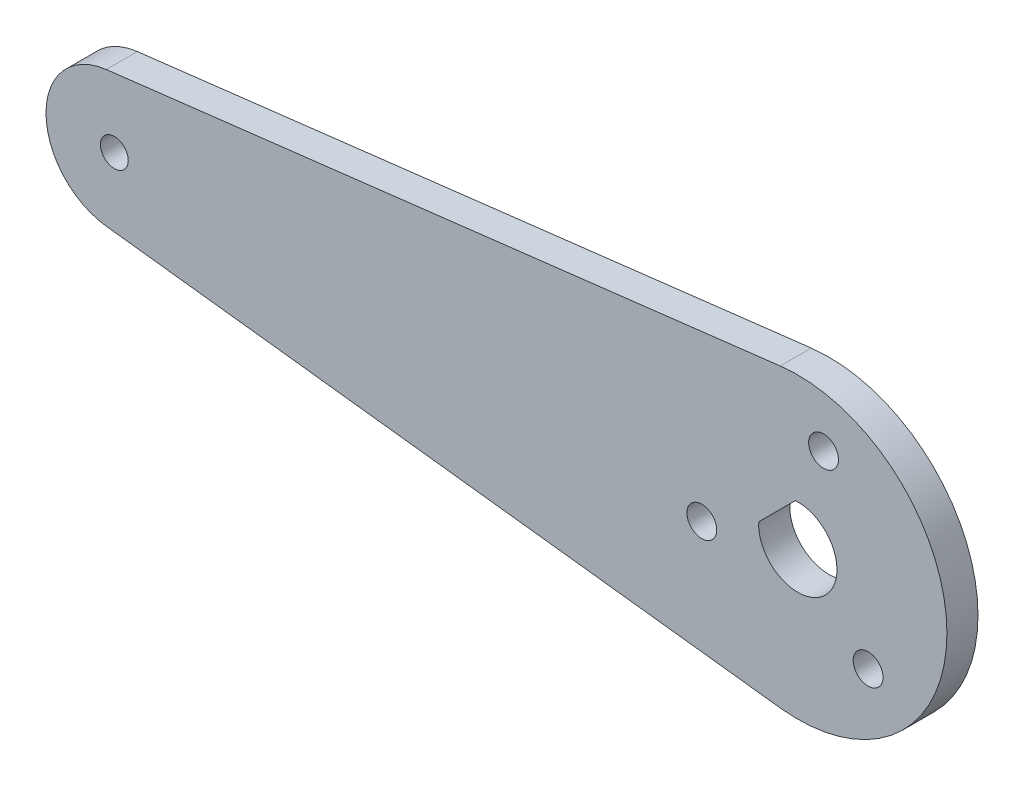
ISO-10303-21;
HEADER;
FILE_DESCRIPTION(('STEP AP214'),'2;1');
FILE_NAME('part.step','',(''),(''),'','','');
FILE_SCHEMA(('AUTOMOTIVE_DESIGN { 1 0 10303 214 1 1 1 1 }'));
ENDSEC;
DATA;
#1=APPLICATION_CONTEXT('core data for automotive mechanical design processes');
#2=APPLICATION_PROTOCOL_DEFINITION('international standard','automotive_design',2000,#1);
#3=PRODUCT_CONTEXT('',#1,'mechanical');
#4=PRODUCT('Part','Part','',(#3));
#5=PRODUCT_RELATED_PRODUCT_CATEGORY('part','',(#4));
#6=PRODUCT_DEFINITION_FORMATION('','',#4);
#7=PRODUCT_DEFINITION_CONTEXT('part definition',#1,'design');
#8=PRODUCT_DEFINITION('design','',#6,#7);
#9=PRODUCT_DEFINITION_SHAPE('','',#8);
#10=(LENGTH_UNIT() NAMED_UNIT(*) SI_UNIT(.MILLI.,.METRE.));
#11=(NAMED_UNIT(*) PLANE_ANGLE_UNIT() SI_UNIT($,.RADIAN.));
#12=(NAMED_UNIT(*) SI_UNIT($,.STERADIAN.) SOLID_ANGLE_UNIT());
#13=UNCERTAINTY_MEASURE_WITH_UNIT(LENGTH_MEASURE(1.E-05),#10,'distance_accuracy_value','');
#14=(GEOMETRIC_REPRESENTATION_CONTEXT(3) GLOBAL_UNCERTAINTY_ASSIGNED_CONTEXT((#13)) GLOBAL_UNIT_ASSIGNED_CONTEXT((#10,
#11,#12)) REPRESENTATION_CONTEXT('',''));
#15=CARTESIAN_POINT('',(0.,0.,0.));
#16=DIRECTION('',(0.,0.,1.));
#17=DIRECTION('',(1.,0.,0.));
#18=AXIS2_PLACEMENT_3D('',#15,#16,#17);
#19=CARTESIAN_POINT('',(-69.85,0.,3.175));
#20=DIRECTION('',(0.,0.,1.));
#21=DIRECTION('',(1.,0.,0.));
#22=AXIS2_PLACEMENT_3D('',#19,#20,#21);
#23=PLANE('',#22);
#24=CARTESIAN_POINT('',(-9.81380639509672,-2.62960149824149,3.175));
#25=DIRECTION('',(0.,0.,1.));
#26=DIRECTION('',(1.,0.,0.));
#27=AXIS2_PLACEMENT_3D('',#24,#25,#26);
#28=CIRCLE('',#27,1.524);
#29=CARTESIAN_POINT('',(-8.28980639509672,-2.62960149824149,3.175));
#30=VERTEX_POINT('',#29);
#31=EDGE_CURVE('E198',#30,#30,#28,.T.);
#32=ORIENTED_EDGE('',*,*,#31,.F.);
#33=EDGE_LOOP('',(#32));
#34=FACE_BOUND('',#33,.T.);
#35=DIRECTION('',(-0.707106781186551,-0.707106781186544,0.));
#36=VECTOR('',#35,1.);
#37=CARTESIAN_POINT('',(-0.250491650172649,3.99214903694661,3.175));
#38=LINE('',#37,#36);
#39=CARTESIAN_POINT('',(-0.25049165017265,3.99214903694659,3.175));
#40=VERTEX_POINT('',#39);
#41=CARTESIAN_POINT('',(-3.99214903694661,0.25049165017269,3.175));
#42=VERTEX_POINT('',#41);
#43=EDGE_CURVE('E82',#40,#42,#38,.T.);
#44=ORIENTED_EDGE('',*,*,#43,.F.);
#45=CARTESIAN_POINT('',(0.,0.,3.175));
#46=DIRECTION('',(0.,0.,1.));
#47=DIRECTION('',(-1.,0.,0.));
#48=AXIS2_PLACEMENT_3D('',#45,#46,#47);
#49=CIRCLE('',#48,4.);
#50=EDGE_CURVE('E88',#42,#40,#49,.T.);
#51=ORIENTED_EDGE('',*,*,#50,.F.);
#52=EDGE_LOOP('',(#44,#51));
#53=FACE_BOUND('',#52,.T.);
#54=CARTESIAN_POINT('',(-69.85,0.,3.175));
#55=DIRECTION('',(0.,0.,1.));
#56=DIRECTION('',(1.,0.,0.));
#57=AXIS2_PLACEMENT_3D('',#54,#55,#56);
#58=CIRCLE('',#57,6.985);
#59=CARTESIAN_POINT('',(-70.6755,6.93604892932569,3.175));
#60=VERTEX_POINT('',#59);
#61=CARTESIAN_POINT('',(-70.6755,-6.93604892932569,3.175));
#62=VERTEX_POINT('',#61);
#63=EDGE_CURVE('E110',#60,#62,#58,.T.);
#64=ORIENTED_EDGE('',*,*,#63,.T.);
#65=DIRECTION('',(0.992991972702317,-0.118181818181818,0.));
#66=VECTOR('',#65,1.);
#67=CARTESIAN_POINT('',(-70.6755,-6.93604892932569,3.175));
#68=LINE('',#67,#66);
#69=CARTESIAN_POINT('',(-1.8010909090909,-15.1331976639833,3.175));
#70=VERTEX_POINT('',#69);
#71=EDGE_CURVE('E113',#62,#70,#68,.T.);
#72=ORIENTED_EDGE('',*,*,#71,.T.);
#73=CARTESIAN_POINT('',(0.,0.,3.175));
#74=DIRECTION('',(0.,0.,1.));
#75=DIRECTION('',(-1.,0.,0.));
#76=AXIS2_PLACEMENT_3D('',#73,#74,#75);
#77=CIRCLE('',#76,15.24);
#78=CARTESIAN_POINT('',(-1.80109090909091,15.1331976639833,3.175));
#79=VERTEX_POINT('',#78);
#80=EDGE_CURVE('E116',#70,#79,#77,.T.);
#81=ORIENTED_EDGE('',*,*,#80,.T.);
#82=DIRECTION('',(-0.992991972702317,-0.118181818181818,0.));
#83=VECTOR('',#82,1.);
#84=CARTESIAN_POINT('',(-70.6755,6.93604892932569,3.175));
#85=LINE('',#84,#83);
#86=EDGE_CURVE('E118',#79,#60,#85,.T.);
#87=ORIENTED_EDGE('',*,*,#86,.T.);
#88=EDGE_LOOP('',(#64,#72,#81,#87));
#89=FACE_BOUND('',#88,.T.);
#90=CARTESIAN_POINT('',(-69.85,0.,3.175));
#91=DIRECTION('',(0.,0.,1.));
#92=DIRECTION('',(1.,0.,0.));
#93=AXIS2_PLACEMENT_3D('',#90,#91,#92);
#94=CIRCLE('',#93,1.42239999999999);
#95=CARTESIAN_POINT('',(-68.4276,0.,3.175));
#96=VERTEX_POINT('',#95);
#97=EDGE_CURVE('E104',#96,#96,#94,.T.);
#98=ORIENTED_EDGE('',*,*,#97,.F.);
#99=EDGE_LOOP('',(#98));
#100=FACE_BOUND('',#99,.T.);
#101=CARTESIAN_POINT('',(7.18420489685532,-7.18420489685532,3.175));
#102=DIRECTION('',(0.,0.,1.));
#103=DIRECTION('',(1.,0.,0.));
#104=AXIS2_PLACEMENT_3D('',#101,#102,#103);
#105=CIRCLE('',#104,1.524);
#106=CARTESIAN_POINT('',(8.70820489685532,-7.18420489685532,3.175));
#107=VERTEX_POINT('',#106);
#108=EDGE_CURVE('E100',#107,#107,#105,.T.);
#109=ORIENTED_EDGE('',*,*,#108,.F.);
#110=EDGE_LOOP('',(#109));
#111=FACE_BOUND('',#110,.T.);
#112=CARTESIAN_POINT('',(2.62960149824183,9.81380639509681,3.175));
#113=DIRECTION('',(0.,0.,1.));
#114=DIRECTION('',(1.,0.,0.));
#115=AXIS2_PLACEMENT_3D('',#112,#113,#114);
#116=CIRCLE('',#115,1.524);
#117=CARTESIAN_POINT('',(4.15360149824183,9.81380639509681,3.175));
#118=VERTEX_POINT('',#117);
#119=EDGE_CURVE('E192',#118,#118,#116,.T.);
#120=ORIENTED_EDGE('',*,*,#119,.F.);
#121=EDGE_LOOP('',(#120));
#122=FACE_BOUND('',#121,.T.);
#123=ADVANCED_FACE('F30',(#34,#53,#89,#100,#111,#122),#23,.T.);
#124=CARTESIAN_POINT('',(-69.85,0.,0.));
#125=DIRECTION('',(0.,0.,1.));
#126=DIRECTION('',(1.,0.,0.));
#127=AXIS2_PLACEMENT_3D('',#124,#125,#126);
#128=PLANE('',#127);
#129=CARTESIAN_POINT('',(-9.81380639509672,-2.62960149824149,0.));
#130=DIRECTION('',(0.,0.,1.));
#131=DIRECTION('',(1.,0.,0.));
#132=AXIS2_PLACEMENT_3D('',#129,#130,#131);
#133=CIRCLE('',#132,1.524);
#134=CARTESIAN_POINT('',(-8.28980639509672,-2.62960149824149,0.));
#135=VERTEX_POINT('',#134);
#136=EDGE_CURVE('E195',#135,#135,#133,.T.);
#137=ORIENTED_EDGE('',*,*,#136,.T.);
#138=EDGE_LOOP('',(#137));
#139=FACE_BOUND('',#138,.T.);
#140=CARTESIAN_POINT('',(0.,0.,0.));
#141=DIRECTION('',(0.,0.,1.));
#142=DIRECTION('',(-1.,0.,0.));
#143=AXIS2_PLACEMENT_3D('',#140,#141,#142);
#144=CIRCLE('',#143,4.);
#145=CARTESIAN_POINT('',(-3.99214903694659,0.250491650172692,0.));
#146=VERTEX_POINT('',#145);
#147=CARTESIAN_POINT('',(-0.250491650172649,3.99214903694661,0.));
#148=VERTEX_POINT('',#147);
#149=EDGE_CURVE('E52',#146,#148,#144,.T.);
#150=ORIENTED_EDGE('',*,*,#149,.T.);
#151=DIRECTION('',(-0.707106781186551,-0.707106781186544,0.));
#152=VECTOR('',#151,1.);
#153=CARTESIAN_POINT('',(-0.250491650172649,3.99214903694661,0.));
#154=LINE('',#153,#152);
#155=EDGE_CURVE('E93',#148,#146,#154,.T.);
#156=ORIENTED_EDGE('',*,*,#155,.T.);
#157=EDGE_LOOP('',(#150,#156));
#158=FACE_BOUND('',#157,.T.);
#159=CARTESIAN_POINT('',(-69.85,0.,0.));
#160=DIRECTION('',(0.,0.,1.));
#161=DIRECTION('',(1.,0.,0.));
#162=AXIS2_PLACEMENT_3D('',#159,#160,#161);
#163=CIRCLE('',#162,6.985);
#164=CARTESIAN_POINT('',(-70.6755,6.93604892932569,0.));
#165=VERTEX_POINT('',#164);
#166=CARTESIAN_POINT('',(-70.6755,-6.93604892932569,0.));
#167=VERTEX_POINT('',#166);
#168=EDGE_CURVE('E107',#165,#167,#163,.T.);
#169=ORIENTED_EDGE('',*,*,#168,.F.);
#170=DIRECTION('',(-0.992991972702317,-0.118181818181818,0.));
#171=VECTOR('',#170,1.);
#172=CARTESIAN_POINT('',(-70.6755,6.93604892932569,0.));
#173=LINE('',#172,#171);
#174=CARTESIAN_POINT('',(-1.80109090909091,15.1331976639833,0.));
#175=VERTEX_POINT('',#174);
#176=EDGE_CURVE('E114',#175,#165,#173,.T.);
#177=ORIENTED_EDGE('',*,*,#176,.F.);
#178=CARTESIAN_POINT('',(0.,0.,0.));
#179=DIRECTION('',(0.,0.,1.));
#180=DIRECTION('',(-1.,0.,0.));
#181=AXIS2_PLACEMENT_3D('',#178,#179,#180);
#182=CIRCLE('',#181,15.24);
#183=CARTESIAN_POINT('',(-1.8010909090909,-15.1331976639833,0.));
#184=VERTEX_POINT('',#183);
#185=EDGE_CURVE('E125',#184,#175,#182,.T.);
#186=ORIENTED_EDGE('',*,*,#185,.F.);
#187=DIRECTION('',(0.992991972702317,-0.118181818181818,0.));
#188=VECTOR('',#187,1.);
#189=CARTESIAN_POINT('',(-70.6755,-6.93604892932569,0.));
#190=LINE('',#189,#188);
#191=EDGE_CURVE('E123',#167,#184,#190,.T.);
#192=ORIENTED_EDGE('',*,*,#191,.F.);
#193=EDGE_LOOP('',(#169,#177,#186,#192));
#194=FACE_BOUND('',#193,.T.);
#195=CARTESIAN_POINT('',(-69.85,0.,0.));
#196=DIRECTION('',(0.,0.,1.));
#197=DIRECTION('',(1.,0.,0.));
#198=AXIS2_PLACEMENT_3D('',#195,#196,#197);
#199=CIRCLE('',#198,1.42239999999999);
#200=CARTESIAN_POINT('',(-68.4276,0.,0.));
#201=VERTEX_POINT('',#200);
#202=EDGE_CURVE('E103',#201,#201,#199,.T.);
#203=ORIENTED_EDGE('',*,*,#202,.T.);
#204=EDGE_LOOP('',(#203));
#205=FACE_BOUND('',#204,.T.);
#206=CARTESIAN_POINT('',(7.18420489685532,-7.18420489685532,0.));
#207=DIRECTION('',(0.,0.,1.));
#208=DIRECTION('',(1.,0.,0.));
#209=AXIS2_PLACEMENT_3D('',#206,#207,#208);
#210=CIRCLE('',#209,1.524);
#211=CARTESIAN_POINT('',(8.70820489685532,-7.18420489685532,0.));
#212=VERTEX_POINT('',#211);
#213=EDGE_CURVE('E97',#212,#212,#210,.T.);
#214=ORIENTED_EDGE('',*,*,#213,.T.);
#215=EDGE_LOOP('',(#214));
#216=FACE_BOUND('',#215,.T.);
#217=CARTESIAN_POINT('',(2.62960149824183,9.81380639509681,0.));
#218=DIRECTION('',(0.,0.,1.));
#219=DIRECTION('',(1.,0.,0.));
#220=AXIS2_PLACEMENT_3D('',#217,#218,#219);
#221=CIRCLE('',#220,1.524);
#222=CARTESIAN_POINT('',(4.15360149824183,9.81380639509681,0.));
#223=VERTEX_POINT('',#222);
#224=EDGE_CURVE('E190',#223,#223,#221,.T.);
#225=ORIENTED_EDGE('',*,*,#224,.T.);
#226=EDGE_LOOP('',(#225));
#227=FACE_BOUND('',#226,.T.);
#228=ADVANCED_FACE('F143',(#139,#158,#194,#205,#216,#227),#128,.F.);
#229=CARTESIAN_POINT('',(-69.85,0.,3.175));
#230=DIRECTION('',(0.,0.,-1.));
#231=DIRECTION('',(-1.,0.,0.));
#232=AXIS2_PLACEMENT_3D('',#229,#230,#231);
#233=CYLINDRICAL_SURFACE('',#232,6.985);
#234=ORIENTED_EDGE('',*,*,#168,.T.);
#235=DIRECTION('',(0.,0.,-1.));
#236=VECTOR('',#235,1.);
#237=CARTESIAN_POINT('',(-70.6755,-6.93604892932569,3.175));
#238=LINE('',#237,#236);
#239=EDGE_CURVE('E11',#62,#167,#238,.T.);
#240=ORIENTED_EDGE('',*,*,#239,.F.);
#241=ORIENTED_EDGE('',*,*,#63,.F.);
#242=DIRECTION('',(0.,0.,-1.));
#243=VECTOR('',#242,1.);
#244=CARTESIAN_POINT('',(-70.6755,6.93604892932569,3.175));
#245=LINE('',#244,#243);
#246=EDGE_CURVE('E120',#60,#165,#245,.T.);
#247=ORIENTED_EDGE('',*,*,#246,.T.);
#248=EDGE_LOOP('',(#234,#240,#241,#247));
#249=FACE_BOUND('',#248,.T.);
#250=ADVANCED_FACE('F32',(#249),#233,.T.);
#251=CARTESIAN_POINT('',(-70.6755,-6.93604892932569,3.175));
#252=DIRECTION('',(0.118181818181818,0.992991972702317,0.));
#253=DIRECTION('',(-0.992991972702317,0.118181818181818,0.));
#254=AXIS2_PLACEMENT_3D('',#251,#252,#253);
#255=PLANE('',#254);
#256=ORIENTED_EDGE('',*,*,#191,.T.);
#257=DIRECTION('',(0.,0.,-1.));
#258=VECTOR('',#257,1.);
#259=CARTESIAN_POINT('',(-1.8010909090909,-15.1331976639833,3.175));
#260=LINE('',#259,#258);
#261=EDGE_CURVE('E38',#70,#184,#260,.T.);
#262=ORIENTED_EDGE('',*,*,#261,.F.);
#263=ORIENTED_EDGE('',*,*,#71,.F.);
#264=ORIENTED_EDGE('',*,*,#239,.T.);
#265=EDGE_LOOP('',(#256,#262,#263,#264));
#266=FACE_BOUND('',#265,.T.);
#267=ADVANCED_FACE('F153',(#266),#255,.F.);
#268=CARTESIAN_POINT('',(0.,0.,3.175));
#269=DIRECTION('',(0.,0.,-1.));
#270=DIRECTION('',(-1.,0.,0.));
#271=AXIS2_PLACEMENT_3D('',#268,#269,#270);
#272=CYLINDRICAL_SURFACE('',#271,15.24);
#273=ORIENTED_EDGE('',*,*,#185,.T.);
#274=DIRECTION('',(0.,0.,-1.));
#275=VECTOR('',#274,1.);
#276=CARTESIAN_POINT('',(-1.80109090909091,15.1331976639833,3.175));
#277=LINE('',#276,#275);
#278=EDGE_CURVE('E130',#79,#175,#277,.T.);
#279=ORIENTED_EDGE('',*,*,#278,.F.);
#280=ORIENTED_EDGE('',*,*,#80,.F.);
#281=ORIENTED_EDGE('',*,*,#261,.T.);
#282=EDGE_LOOP('',(#273,#279,#280,#281));
#283=FACE_BOUND('',#282,.T.);
#284=ADVANCED_FACE('F137',(#283),#272,.T.);
#285=CARTESIAN_POINT('',(-70.6755,6.93604892932569,3.175));
#286=DIRECTION('',(0.118181818181818,-0.992991972702317,0.));
#287=DIRECTION('',(0.992991972702317,0.118181818181818,0.));
#288=AXIS2_PLACEMENT_3D('',#285,#286,#287);
#289=PLANE('',#288);
#290=ORIENTED_EDGE('',*,*,#176,.T.);
#291=ORIENTED_EDGE('',*,*,#246,.F.);
#292=ORIENTED_EDGE('',*,*,#86,.F.);
#293=ORIENTED_EDGE('',*,*,#278,.T.);
#294=EDGE_LOOP('',(#290,#291,#292,#293));
#295=FACE_BOUND('',#294,.T.);
#296=ADVANCED_FACE('F147',(#295),#289,.F.);
#297=CARTESIAN_POINT('',(-69.85,0.,3.175));
#298=DIRECTION('',(0.,0.,-1.));
#299=DIRECTION('',(-1.,0.,0.));
#300=AXIS2_PLACEMENT_3D('',#297,#298,#299);
#301=CYLINDRICAL_SURFACE('',#300,1.42239999999999);
#302=ORIENTED_EDGE('',*,*,#97,.T.);
#303=EDGE_LOOP('',(#302));
#304=FACE_BOUND('',#303,.T.);
#305=ORIENTED_EDGE('',*,*,#202,.F.);
#306=EDGE_LOOP('',(#305));
#307=FACE_BOUND('',#306,.T.);
#308=ADVANCED_FACE('F170',(#304,#307),#301,.F.);
#309=CARTESIAN_POINT('',(0.,0.,3.175));
#310=DIRECTION('',(0.,0.,-1.));
#311=DIRECTION('',(-1.,0.,0.));
#312=AXIS2_PLACEMENT_3D('',#309,#310,#311);
#313=CYLINDRICAL_SURFACE('',#312,4.);
#314=ORIENTED_EDGE('',*,*,#149,.F.);
#315=DIRECTION('',(0.,0.,-1.));
#316=VECTOR('',#315,1.);
#317=CARTESIAN_POINT('',(-3.99214903694661,0.25049165017269,3.175));
#318=LINE('',#317,#316);
#319=EDGE_CURVE('E84',#42,#146,#318,.T.);
#320=ORIENTED_EDGE('',*,*,#319,.F.);
#321=ORIENTED_EDGE('',*,*,#50,.T.);
#322=DIRECTION('',(0.,0.,-1.));
#323=VECTOR('',#322,1.);
#324=CARTESIAN_POINT('',(-0.250491650172649,3.99214903694661,3.175));
#325=LINE('',#324,#323);
#326=EDGE_CURVE('E45',#40,#148,#325,.T.);
#327=ORIENTED_EDGE('',*,*,#326,.T.);
#328=EDGE_LOOP('',(#314,#320,#321,#327));
#329=FACE_BOUND('',#328,.T.);
#330=ADVANCED_FACE('F90',(#329),#313,.F.);
#331=CARTESIAN_POINT('',(-0.250491650172649,3.99214903694661,3.175));
#332=DIRECTION('',(0.707106781186544,-0.707106781186551,0.));
#333=DIRECTION('',(0.707106781186551,0.707106781186544,0.));
#334=AXIS2_PLACEMENT_3D('',#331,#332,#333);
#335=PLANE('',#334);
#336=ORIENTED_EDGE('',*,*,#155,.F.);
#337=ORIENTED_EDGE('',*,*,#326,.F.);
#338=ORIENTED_EDGE('',*,*,#43,.T.);
#339=ORIENTED_EDGE('',*,*,#319,.T.);
#340=EDGE_LOOP('',(#336,#337,#338,#339));
#341=FACE_BOUND('',#340,.T.);
#342=ADVANCED_FACE('F83',(#341),#335,.T.);
#343=CARTESIAN_POINT('',(7.18420489685532,-7.18420489685532,3.175));
#344=DIRECTION('',(0.,0.,-1.));
#345=DIRECTION('',(-1.,0.,0.));
#346=AXIS2_PLACEMENT_3D('',#343,#344,#345);
#347=CYLINDRICAL_SURFACE('',#346,1.524);
#348=ORIENTED_EDGE('',*,*,#108,.T.);
#349=EDGE_LOOP('',(#348));
#350=FACE_BOUND('',#349,.T.);
#351=ORIENTED_EDGE('',*,*,#213,.F.);
#352=EDGE_LOOP('',(#351));
#353=FACE_BOUND('',#352,.T.);
#354=ADVANCED_FACE('F205',(#350,#353),#347,.F.);
#355=CARTESIAN_POINT('',(-9.81380639509672,-2.62960149824149,3.175));
#356=DIRECTION('',(0.,0.,-1.));
#357=DIRECTION('',(-1.,0.,0.));
#358=AXIS2_PLACEMENT_3D('',#355,#356,#357);
#359=CYLINDRICAL_SURFACE('',#358,1.524);
#360=ORIENTED_EDGE('',*,*,#31,.T.);
#361=EDGE_LOOP('',(#360));
#362=FACE_BOUND('',#361,.T.);
#363=ORIENTED_EDGE('',*,*,#136,.F.);
#364=EDGE_LOOP('',(#363));
#365=FACE_BOUND('',#364,.T.);
#366=ADVANCED_FACE('F213',(#362,#365),#359,.F.);
#367=CARTESIAN_POINT('',(2.62960149824183,9.81380639509681,3.175));
#368=DIRECTION('',(0.,0.,-1.));
#369=DIRECTION('',(-1.,0.,0.));
#370=AXIS2_PLACEMENT_3D('',#367,#368,#369);
#371=CYLINDRICAL_SURFACE('',#370,1.524);
#372=ORIENTED_EDGE('',*,*,#119,.T.);
#373=EDGE_LOOP('',(#372));
#374=FACE_BOUND('',#373,.T.);
#375=ORIENTED_EDGE('',*,*,#224,.F.);
#376=EDGE_LOOP('',(#375));
#377=FACE_BOUND('',#376,.T.);
#378=ADVANCED_FACE('F211',(#374,#377),#371,.F.);
#379=CLOSED_SHELL('',(#123,#228,#250,#267,#284,#296,#308,#330,#342,#354,#366,#378));
#380=MANIFOLD_SOLID_BREP('B2',#379);
#381=ADVANCED_BREP_SHAPE_REPRESENTATION('',(#18,#380),#14);
#382=SHAPE_DEFINITION_REPRESENTATION(#9,#381);
ENDSEC;
END-ISO-10303-21;
